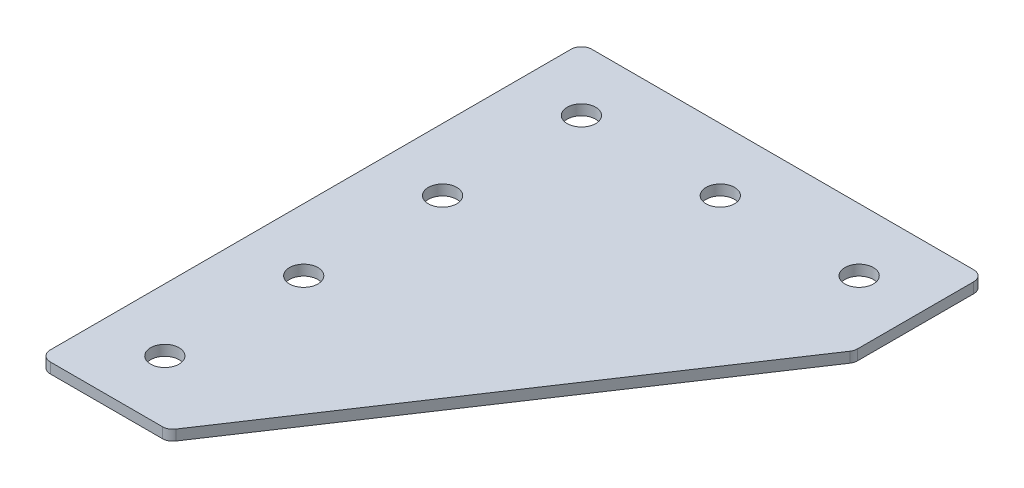
ISO-10303-21;
HEADER;
FILE_DESCRIPTION(('STEP AP214'),'2;1');
FILE_NAME('part.step','',(''),(''),'','','');
FILE_SCHEMA(('AUTOMOTIVE_DESIGN { 1 0 10303 214 1 1 1 1 }'));
ENDSEC;
DATA;
#1=APPLICATION_CONTEXT('core data for automotive mechanical design processes');
#2=APPLICATION_PROTOCOL_DEFINITION('international standard','automotive_design',2000,#1);
#3=PRODUCT_CONTEXT('',#1,'mechanical');
#4=PRODUCT('Part','Part','',(#3));
#5=PRODUCT_RELATED_PRODUCT_CATEGORY('part','',(#4));
#6=PRODUCT_DEFINITION_FORMATION('','',#4);
#7=PRODUCT_DEFINITION_CONTEXT('part definition',#1,'design');
#8=PRODUCT_DEFINITION('design','',#6,#7);
#9=PRODUCT_DEFINITION_SHAPE('','',#8);
#10=(LENGTH_UNIT() NAMED_UNIT(*) SI_UNIT(.MILLI.,.METRE.));
#11=(NAMED_UNIT(*) PLANE_ANGLE_UNIT() SI_UNIT($,.RADIAN.));
#12=(NAMED_UNIT(*) SI_UNIT($,.STERADIAN.) SOLID_ANGLE_UNIT());
#13=UNCERTAINTY_MEASURE_WITH_UNIT(LENGTH_MEASURE(1.E-05),#10,'distance_accuracy_value','');
#14=(GEOMETRIC_REPRESENTATION_CONTEXT(3) GLOBAL_UNCERTAINTY_ASSIGNED_CONTEXT((#13)) GLOBAL_UNIT_ASSIGNED_CONTEXT((#10,
#11,#12)) REPRESENTATION_CONTEXT('',''));
#15=CARTESIAN_POINT('',(0.,0.,0.));
#16=DIRECTION('',(0.,0.,1.));
#17=DIRECTION('',(1.,0.,0.));
#18=AXIS2_PLACEMENT_3D('',#15,#16,#17);
#19=CARTESIAN_POINT('',(-42.2329305968469,1.64126526075142,-60.907824161743));
#20=DIRECTION('',(0.,-1.,0.));
#21=DIRECTION('',(0.,0.,-1.));
#22=AXIS2_PLACEMENT_3D('',#19,#20,#21);
#23=PLANE('',#22);
#24=CARTESIAN_POINT('',(-42.2329305968469,1.64126526075142,59.092175838257));
#25=DIRECTION('',(0.,1.,0.));
#26=DIRECTION('',(0.,0.,1.));
#27=AXIS2_PLACEMENT_3D('',#24,#25,#26);
#28=CIRCLE('',#27,4.1);
#29=CARTESIAN_POINT('',(-42.2329305968469,1.64126526075142,63.192175838257));
#30=VERTEX_POINT('',#29);
#31=EDGE_CURVE('E253',#30,#30,#28,.T.);
#32=ORIENTED_EDGE('',*,*,#31,.T.);
#33=EDGE_LOOP('',(#32));
#34=FACE_BOUND('',#33,.T.);
#35=CARTESIAN_POINT('',(37.7670694031531,1.64126526075142,-60.907824161743));
#36=DIRECTION('',(0.,1.,0.));
#37=DIRECTION('',(0.,0.,1.));
#38=AXIS2_PLACEMENT_3D('',#35,#36,#37);
#39=CIRCLE('',#38,4.1);
#40=CARTESIAN_POINT('',(37.7670694031531,1.64126526075142,-56.807824161743));
#41=VERTEX_POINT('',#40);
#42=EDGE_CURVE('E261',#41,#41,#39,.T.);
#43=ORIENTED_EDGE('',*,*,#42,.T.);
#44=EDGE_LOOP('',(#43));
#45=FACE_BOUND('',#44,.T.);
#46=CARTESIAN_POINT('',(-42.2329305968469,1.64126526075142,19.092175838257));
#47=DIRECTION('',(0.,1.,0.));
#48=DIRECTION('',(0.,0.,1.));
#49=AXIS2_PLACEMENT_3D('',#46,#47,#48);
#50=CIRCLE('',#49,4.1);
#51=CARTESIAN_POINT('',(-42.2329305968469,1.64126526075142,23.192175838257));
#52=VERTEX_POINT('',#51);
#53=EDGE_CURVE('E267',#52,#52,#50,.T.);
#54=ORIENTED_EDGE('',*,*,#53,.T.);
#55=EDGE_LOOP('',(#54));
#56=FACE_BOUND('',#55,.T.);
#57=CARTESIAN_POINT('',(-42.2329305968469,1.64126526075142,-20.907824161743));
#58=DIRECTION('',(0.,1.,0.));
#59=DIRECTION('',(0.,0.,1.));
#60=AXIS2_PLACEMENT_3D('',#57,#58,#59);
#61=CIRCLE('',#60,4.1);
#62=CARTESIAN_POINT('',(-42.2329305968469,1.64126526075142,-16.807824161743));
#63=VERTEX_POINT('',#62);
#64=EDGE_CURVE('E273',#63,#63,#61,.T.);
#65=ORIENTED_EDGE('',*,*,#64,.T.);
#66=EDGE_LOOP('',(#65));
#67=FACE_BOUND('',#66,.T.);
#68=CARTESIAN_POINT('',(-2.23293059684691,1.64126526075142,-60.907824161743));
#69=DIRECTION('',(0.,1.,0.));
#70=DIRECTION('',(0.,0.,1.));
#71=AXIS2_PLACEMENT_3D('',#68,#69,#70);
#72=CIRCLE('',#71,4.1);
#73=CARTESIAN_POINT('',(-2.23293059684691,1.64126526075142,-56.807824161743));
#74=VERTEX_POINT('',#73);
#75=EDGE_CURVE('E279',#74,#74,#72,.T.);
#76=ORIENTED_EDGE('',*,*,#75,.T.);
#77=EDGE_LOOP('',(#76));
#78=FACE_BOUND('',#77,.T.);
#79=CARTESIAN_POINT('',(-42.2329305968469,1.64126526075142,-60.907824161743));
#80=DIRECTION('',(0.,1.,0.));
#81=DIRECTION('',(0.,0.,1.));
#82=AXIS2_PLACEMENT_3D('',#79,#80,#81);
#83=CIRCLE('',#82,4.1);
#84=CARTESIAN_POINT('',(-42.2329305968469,1.64126526075142,-56.807824161743));
#85=VERTEX_POINT('',#84);
#86=EDGE_CURVE('E176',#85,#85,#83,.T.);
#87=ORIENTED_EDGE('',*,*,#86,.T.);
#88=EDGE_LOOP('',(#87));
#89=FACE_BOUND('',#88,.T.);
#90=DIRECTION('',(1.,0.,0.));
#91=VECTOR('',#90,1.);
#92=CARTESIAN_POINT('',(-60.2329305968469,1.64126526075142,77.0921758382569));
#93=LINE('',#92,#91);
#94=CARTESIAN_POINT('',(-57.2329305968469,1.64126526075142,77.0921758382569));
#95=VERTEX_POINT('',#94);
#96=CARTESIAN_POINT('',(-24.9088493892869,1.64126526075142,77.0921758382569));
#97=VERTEX_POINT('',#96);
#98=EDGE_CURVE('E165',#95,#97,#93,.T.);
#99=ORIENTED_EDGE('',*,*,#98,.F.);
#100=CARTESIAN_POINT('',(-57.2329305968469,1.64126526075142,74.0921758382569));
#101=DIRECTION('',(0.,-1.,0.));
#102=DIRECTION('',(0.,0.,-1.));
#103=AXIS2_PLACEMENT_3D('',#100,#101,#102);
#104=CIRCLE('',#103,3.);
#105=CARTESIAN_POINT('',(-60.2329305968469,1.64126526075142,74.0921758382569));
#106=VERTEX_POINT('',#105);
#107=EDGE_CURVE('E146',#95,#106,#104,.T.);
#108=ORIENTED_EDGE('',*,*,#107,.T.);
#109=DIRECTION('',(0.,0.,1.));
#110=VECTOR('',#109,1.);
#111=CARTESIAN_POINT('',(-60.2329305968469,1.64126526075142,-78.907824161743));
#112=LINE('',#111,#110);
#113=CARTESIAN_POINT('',(-60.2329305968469,1.64126526075142,-75.907824161743));
#114=VERTEX_POINT('',#113);
#115=EDGE_CURVE('E163',#114,#106,#112,.T.);
#116=ORIENTED_EDGE('',*,*,#115,.F.);
#117=CARTESIAN_POINT('',(-57.2329305968469,1.64126526075142,-75.907824161743));
#118=DIRECTION('',(0.,-1.,0.));
#119=DIRECTION('',(0.,0.,-1.));
#120=AXIS2_PLACEMENT_3D('',#117,#118,#119);
#121=CIRCLE('',#120,3.);
#122=CARTESIAN_POINT('',(-57.2329305968469,1.64126526075142,-78.907824161743));
#123=VERTEX_POINT('',#122);
#124=EDGE_CURVE('E117',#114,#123,#121,.T.);
#125=ORIENTED_EDGE('',*,*,#124,.T.);
#126=DIRECTION('',(-1.,0.,0.));
#127=VECTOR('',#126,1.);
#128=CARTESIAN_POINT('',(55.7670694031531,1.64126526075142,-78.9078241617431));
#129=LINE('',#128,#127);
#130=CARTESIAN_POINT('',(52.7670694031531,1.64126526075142,-78.9078241617431));
#131=VERTEX_POINT('',#130);
#132=EDGE_CURVE('E161',#131,#123,#129,.T.);
#133=ORIENTED_EDGE('',*,*,#132,.F.);
#134=CARTESIAN_POINT('',(52.7670694031531,1.64126526075142,-75.9078241617431));
#135=DIRECTION('',(0.,-1.,0.));
#136=DIRECTION('',(0.,0.,-1.));
#137=AXIS2_PLACEMENT_3D('',#134,#135,#136);
#138=CIRCLE('',#137,3.);
#139=CARTESIAN_POINT('',(55.7670694031531,1.64126526075142,-75.9078241617431));
#140=VERTEX_POINT('',#139);
#141=EDGE_CURVE('E141',#131,#140,#138,.T.);
#142=ORIENTED_EDGE('',*,*,#141,.T.);
#143=DIRECTION('',(0.,0.,-1.));
#144=VECTOR('',#143,1.);
#145=CARTESIAN_POINT('',(55.7670694031531,1.64126526075142,-41.5133754372071));
#146=LINE('',#145,#144);
#147=CARTESIAN_POINT('',(55.7670694031531,1.64126526075142,-42.421702350403));
#148=VERTEX_POINT('',#147);
#149=EDGE_CURVE('E118',#148,#140,#146,.T.);
#150=ORIENTED_EDGE('',*,*,#149,.F.);
#151=CARTESIAN_POINT('',(52.7670694031531,1.64126526075142,-42.421702350403));
#152=DIRECTION('',(0.,-1.,0.));
#153=DIRECTION('',(0.,0.,-1.));
#154=AXIS2_PLACEMENT_3D('',#151,#152,#153);
#155=CIRCLE('',#154,3.);
#156=CARTESIAN_POINT('',(55.2632202861666,1.64126526075142,-40.7576017617274));
#157=VERTEX_POINT('',#156);
#158=EDGE_CURVE('E31',#148,#157,#155,.T.);
#159=ORIENTED_EDGE('',*,*,#158,.T.);
#160=DIRECTION('',(0.554700196225229,0.,-0.832050294337844));
#161=VECTOR('',#160,1.);
#162=CARTESIAN_POINT('',(-23.303298113823,1.64126526075142,77.0921758382569));
#163=LINE('',#162,#161);
#164=CARTESIAN_POINT('',(-22.4126985062734,1.64126526075142,75.7562764269326));
#165=VERTEX_POINT('',#164);
#166=EDGE_CURVE('E122',#165,#157,#163,.T.);
#167=ORIENTED_EDGE('',*,*,#166,.F.);
#168=CARTESIAN_POINT('',(-24.9088493892869,1.64126526075142,74.0921758382569));
#169=DIRECTION('',(0.,-1.,0.));
#170=DIRECTION('',(0.,0.,-1.));
#171=AXIS2_PLACEMENT_3D('',#168,#169,#170);
#172=CIRCLE('',#171,3.);
#173=EDGE_CURVE('E144',#165,#97,#172,.T.);
#174=ORIENTED_EDGE('',*,*,#173,.T.);
#175=EDGE_LOOP('',(#99,#108,#116,#125,#133,#142,#150,#159,#167,#174));
#176=FACE_BOUND('',#175,.T.);
#177=ADVANCED_FACE('F16',(#34,#45,#56,#67,#78,#89,#176),#23,.T.);
#178=CARTESIAN_POINT('',(55.7670694031531,1.64126526075142,-78.9078241617431));
#179=DIRECTION('',(0.,0.,-1.));
#180=DIRECTION('',(-1.,0.,0.));
#181=AXIS2_PLACEMENT_3D('',#178,#179,#180);
#182=PLANE('',#181);
#183=DIRECTION('',(-1.,0.,0.));
#184=VECTOR('',#183,1.);
#185=CARTESIAN_POINT('',(55.7670694031531,4.64126526075142,-78.9078241617431));
#186=LINE('',#185,#184);
#187=CARTESIAN_POINT('',(52.7670694031531,4.64126526075142,-78.9078241617431));
#188=VERTEX_POINT('',#187);
#189=CARTESIAN_POINT('',(-57.2329305968469,4.64126526075142,-78.907824161743));
#190=VERTEX_POINT('',#189);
#191=EDGE_CURVE('E99',#188,#190,#186,.T.);
#192=ORIENTED_EDGE('',*,*,#191,.F.);
#193=DIRECTION('',(0.,1.,0.));
#194=VECTOR('',#193,1.);
#195=CARTESIAN_POINT('',(52.7670694031531,1.64126526075142,-78.9078241617431));
#196=LINE('',#195,#194);
#197=EDGE_CURVE('E10',#188,#131,#196,.F.);
#198=ORIENTED_EDGE('',*,*,#197,.T.);
#199=ORIENTED_EDGE('',*,*,#132,.T.);
#200=DIRECTION('',(0.,1.,0.));
#201=VECTOR('',#200,1.);
#202=CARTESIAN_POINT('',(-57.2329305968469,1.64126526075142,-78.907824161743));
#203=LINE('',#202,#201);
#204=EDGE_CURVE('E24',#123,#190,#203,.T.);
#205=ORIENTED_EDGE('',*,*,#204,.T.);
#206=EDGE_LOOP('',(#192,#198,#199,#205));
#207=FACE_BOUND('',#206,.T.);
#208=ADVANCED_FACE('F158',(#207),#182,.T.);
#209=CARTESIAN_POINT('',(55.7670694031531,1.64126526075142,-41.5133754372071));
#210=DIRECTION('',(1.,0.,0.));
#211=DIRECTION('',(0.,0.,-1.));
#212=AXIS2_PLACEMENT_3D('',#209,#210,#211);
#213=PLANE('',#212);
#214=DIRECTION('',(0.,0.,-1.));
#215=VECTOR('',#214,1.);
#216=CARTESIAN_POINT('',(55.7670694031531,4.64126526075142,-41.5133754372071));
#217=LINE('',#216,#215);
#218=CARTESIAN_POINT('',(55.7670694031531,4.64126526075142,-42.421702350403));
#219=VERTEX_POINT('',#218);
#220=CARTESIAN_POINT('',(55.7670694031531,4.64126526075142,-75.9078241617431));
#221=VERTEX_POINT('',#220);
#222=EDGE_CURVE('E125',#219,#221,#217,.T.);
#223=ORIENTED_EDGE('',*,*,#222,.F.);
#224=DIRECTION('',(0.,1.,0.));
#225=VECTOR('',#224,1.);
#226=CARTESIAN_POINT('',(55.7670694031531,1.64126526075142,-42.421702350403));
#227=LINE('',#226,#225);
#228=EDGE_CURVE('E155',#219,#148,#227,.F.);
#229=ORIENTED_EDGE('',*,*,#228,.T.);
#230=ORIENTED_EDGE('',*,*,#149,.T.);
#231=DIRECTION('',(0.,1.,0.));
#232=VECTOR('',#231,1.);
#233=CARTESIAN_POINT('',(55.7670694031531,1.64126526075142,-75.9078241617431));
#234=LINE('',#233,#232);
#235=EDGE_CURVE('E152',#140,#221,#234,.T.);
#236=ORIENTED_EDGE('',*,*,#235,.T.);
#237=EDGE_LOOP('',(#223,#229,#230,#236));
#238=FACE_BOUND('',#237,.T.);
#239=ADVANCED_FACE('F212',(#238),#213,.T.);
#240=CARTESIAN_POINT('',(-23.303298113823,1.64126526075142,77.0921758382569));
#241=DIRECTION('',(0.832050294337843,0.,0.554700196225229));
#242=DIRECTION('',(0.554700196225229,0.,-0.832050294337844));
#243=AXIS2_PLACEMENT_3D('',#240,#241,#242);
#244=PLANE('',#243);
#245=DIRECTION('',(0.554700196225229,0.,-0.832050294337844));
#246=VECTOR('',#245,1.);
#247=CARTESIAN_POINT('',(-23.303298113823,4.64126526075142,77.0921758382569));
#248=LINE('',#247,#246);
#249=CARTESIAN_POINT('',(-22.4126985062734,4.64126526075142,75.7562764269326));
#250=VERTEX_POINT('',#249);
#251=CARTESIAN_POINT('',(55.2632202861666,4.64126526075142,-40.7576017617274));
#252=VERTEX_POINT('',#251);
#253=EDGE_CURVE('E168',#250,#252,#248,.T.);
#254=ORIENTED_EDGE('',*,*,#253,.F.);
#255=DIRECTION('',(0.,1.,0.));
#256=VECTOR('',#255,1.);
#257=CARTESIAN_POINT('',(-22.4126985062734,1.64126526075142,75.7562764269326));
#258=LINE('',#257,#256);
#259=EDGE_CURVE('E38',#250,#165,#258,.F.);
#260=ORIENTED_EDGE('',*,*,#259,.T.);
#261=ORIENTED_EDGE('',*,*,#166,.T.);
#262=DIRECTION('',(0.,1.,0.));
#263=VECTOR('',#262,1.);
#264=CARTESIAN_POINT('',(55.2632202861666,1.64126526075142,-40.7576017617274));
#265=LINE('',#264,#263);
#266=EDGE_CURVE('E148',#157,#252,#265,.T.);
#267=ORIENTED_EDGE('',*,*,#266,.T.);
#268=EDGE_LOOP('',(#254,#260,#261,#267));
#269=FACE_BOUND('',#268,.T.);
#270=ADVANCED_FACE('F181',(#269),#244,.T.);
#271=CARTESIAN_POINT('',(-60.2329305968469,1.64126526075142,77.0921758382569));
#272=DIRECTION('',(0.,0.,1.));
#273=DIRECTION('',(1.,0.,0.));
#274=AXIS2_PLACEMENT_3D('',#271,#272,#273);
#275=PLANE('',#274);
#276=DIRECTION('',(1.,0.,0.));
#277=VECTOR('',#276,1.);
#278=CARTESIAN_POINT('',(-60.2329305968469,4.64126526075142,77.0921758382569));
#279=LINE('',#278,#277);
#280=CARTESIAN_POINT('',(-57.2329305968469,4.64126526075142,77.0921758382569));
#281=VERTEX_POINT('',#280);
#282=CARTESIAN_POINT('',(-24.9088493892869,4.64126526075142,77.0921758382569));
#283=VERTEX_POINT('',#282);
#284=EDGE_CURVE('E114',#281,#283,#279,.T.);
#285=ORIENTED_EDGE('',*,*,#284,.F.);
#286=DIRECTION('',(0.,1.,0.));
#287=VECTOR('',#286,1.);
#288=CARTESIAN_POINT('',(-57.2329305968469,1.64126526075142,77.0921758382569));
#289=LINE('',#288,#287);
#290=EDGE_CURVE('E138',#281,#95,#289,.F.);
#291=ORIENTED_EDGE('',*,*,#290,.T.);
#292=ORIENTED_EDGE('',*,*,#98,.T.);
#293=DIRECTION('',(0.,1.,0.));
#294=VECTOR('',#293,1.);
#295=CARTESIAN_POINT('',(-24.9088493892869,1.64126526075142,77.0921758382569));
#296=LINE('',#295,#294);
#297=EDGE_CURVE('E135',#97,#283,#296,.T.);
#298=ORIENTED_EDGE('',*,*,#297,.T.);
#299=EDGE_LOOP('',(#285,#291,#292,#298));
#300=FACE_BOUND('',#299,.T.);
#301=ADVANCED_FACE('F191',(#300),#275,.T.);
#302=CARTESIAN_POINT('',(-60.2329305968469,1.64126526075142,-78.907824161743));
#303=DIRECTION('',(-1.,0.,0.));
#304=DIRECTION('',(0.,0.,1.));
#305=AXIS2_PLACEMENT_3D('',#302,#303,#304);
#306=PLANE('',#305);
#307=ORIENTED_EDGE('',*,*,#115,.T.);
#308=DIRECTION('',(0.,1.,0.));
#309=VECTOR('',#308,1.);
#310=CARTESIAN_POINT('',(-60.2329305968469,1.64126526075142,74.0921758382569));
#311=LINE('',#310,#309);
#312=CARTESIAN_POINT('',(-60.2329305968469,4.64126526075142,74.0921758382569));
#313=VERTEX_POINT('',#312);
#314=EDGE_CURVE('E105',#106,#313,#311,.T.);
#315=ORIENTED_EDGE('',*,*,#314,.T.);
#316=DIRECTION('',(0.,0.,1.));
#317=VECTOR('',#316,1.);
#318=CARTESIAN_POINT('',(-60.2329305968469,4.64126526075142,-78.907824161743));
#319=LINE('',#318,#317);
#320=CARTESIAN_POINT('',(-60.2329305968469,4.64126526075142,-75.907824161743));
#321=VERTEX_POINT('',#320);
#322=EDGE_CURVE('E97',#321,#313,#319,.T.);
#323=ORIENTED_EDGE('',*,*,#322,.F.);
#324=DIRECTION('',(0.,1.,0.));
#325=VECTOR('',#324,1.);
#326=CARTESIAN_POINT('',(-60.2329305968469,1.64126526075142,-75.907824161743));
#327=LINE('',#326,#325);
#328=EDGE_CURVE('E111',#321,#114,#327,.F.);
#329=ORIENTED_EDGE('',*,*,#328,.T.);
#330=EDGE_LOOP('',(#307,#315,#323,#329));
#331=FACE_BOUND('',#330,.T.);
#332=ADVANCED_FACE('F110',(#331),#306,.T.);
#333=CARTESIAN_POINT('',(-42.2329305968469,4.64126526075142,-60.907824161743));
#334=DIRECTION('',(0.,-1.,0.));
#335=DIRECTION('',(0.,0.,-1.));
#336=AXIS2_PLACEMENT_3D('',#333,#334,#335);
#337=PLANE('',#336);
#338=CARTESIAN_POINT('',(-42.2329305968469,4.64126526075142,59.092175838257));
#339=DIRECTION('',(0.,1.,0.));
#340=DIRECTION('',(0.,0.,1.));
#341=AXIS2_PLACEMENT_3D('',#338,#339,#340);
#342=CIRCLE('',#341,4.1);
#343=CARTESIAN_POINT('',(-42.2329305968469,4.64126526075142,63.192175838257));
#344=VERTEX_POINT('',#343);
#345=EDGE_CURVE('E256',#344,#344,#342,.T.);
#346=ORIENTED_EDGE('',*,*,#345,.F.);
#347=EDGE_LOOP('',(#346));
#348=FACE_BOUND('',#347,.T.);
#349=CARTESIAN_POINT('',(37.7670694031531,4.64126526075142,-60.907824161743));
#350=DIRECTION('',(0.,1.,0.));
#351=DIRECTION('',(0.,0.,1.));
#352=AXIS2_PLACEMENT_3D('',#349,#350,#351);
#353=CIRCLE('',#352,4.1);
#354=CARTESIAN_POINT('',(37.7670694031531,4.64126526075142,-56.807824161743));
#355=VERTEX_POINT('',#354);
#356=EDGE_CURVE('E258',#355,#355,#353,.T.);
#357=ORIENTED_EDGE('',*,*,#356,.F.);
#358=EDGE_LOOP('',(#357));
#359=FACE_BOUND('',#358,.T.);
#360=CARTESIAN_POINT('',(-42.2329305968469,4.64126526075142,19.092175838257));
#361=DIRECTION('',(0.,1.,0.));
#362=DIRECTION('',(0.,0.,1.));
#363=AXIS2_PLACEMENT_3D('',#360,#361,#362);
#364=CIRCLE('',#363,4.1);
#365=CARTESIAN_POINT('',(-42.2329305968469,4.64126526075142,23.192175838257));
#366=VERTEX_POINT('',#365);
#367=EDGE_CURVE('E264',#366,#366,#364,.T.);
#368=ORIENTED_EDGE('',*,*,#367,.F.);
#369=EDGE_LOOP('',(#368));
#370=FACE_BOUND('',#369,.T.);
#371=CARTESIAN_POINT('',(-42.2329305968469,4.64126526075142,-20.907824161743));
#372=DIRECTION('',(0.,1.,0.));
#373=DIRECTION('',(0.,0.,1.));
#374=AXIS2_PLACEMENT_3D('',#371,#372,#373);
#375=CIRCLE('',#374,4.1);
#376=CARTESIAN_POINT('',(-42.2329305968469,4.64126526075142,-16.807824161743));
#377=VERTEX_POINT('',#376);
#378=EDGE_CURVE('E270',#377,#377,#375,.T.);
#379=ORIENTED_EDGE('',*,*,#378,.F.);
#380=EDGE_LOOP('',(#379));
#381=FACE_BOUND('',#380,.T.);
#382=CARTESIAN_POINT('',(-2.23293059684691,4.64126526075142,-60.907824161743));
#383=DIRECTION('',(0.,1.,0.));
#384=DIRECTION('',(0.,0.,1.));
#385=AXIS2_PLACEMENT_3D('',#382,#383,#384);
#386=CIRCLE('',#385,4.1);
#387=CARTESIAN_POINT('',(-2.23293059684691,4.64126526075142,-56.807824161743));
#388=VERTEX_POINT('',#387);
#389=EDGE_CURVE('E276',#388,#388,#386,.T.);
#390=ORIENTED_EDGE('',*,*,#389,.F.);
#391=EDGE_LOOP('',(#390));
#392=FACE_BOUND('',#391,.T.);
#393=CARTESIAN_POINT('',(-42.2329305968469,4.64126526075142,-60.907824161743));
#394=DIRECTION('',(0.,1.,0.));
#395=DIRECTION('',(0.,0.,1.));
#396=AXIS2_PLACEMENT_3D('',#393,#394,#395);
#397=CIRCLE('',#396,4.1);
#398=CARTESIAN_POINT('',(-42.2329305968469,4.64126526075142,-56.807824161743));
#399=VERTEX_POINT('',#398);
#400=EDGE_CURVE('E170',#399,#399,#397,.T.);
#401=ORIENTED_EDGE('',*,*,#400,.F.);
#402=EDGE_LOOP('',(#401));
#403=FACE_BOUND('',#402,.T.);
#404=ORIENTED_EDGE('',*,*,#322,.T.);
#405=CARTESIAN_POINT('',(-57.2329305968469,4.64126526075142,74.0921758382569));
#406=DIRECTION('',(0.,-1.,0.));
#407=DIRECTION('',(0.,0.,-1.));
#408=AXIS2_PLACEMENT_3D('',#405,#406,#407);
#409=CIRCLE('',#408,3.);
#410=EDGE_CURVE('E133',#313,#281,#409,.F.);
#411=ORIENTED_EDGE('',*,*,#410,.T.);
#412=ORIENTED_EDGE('',*,*,#284,.T.);
#413=CARTESIAN_POINT('',(-24.9088493892869,4.64126526075142,74.0921758382569));
#414=DIRECTION('',(0.,-1.,0.));
#415=DIRECTION('',(0.,0.,-1.));
#416=AXIS2_PLACEMENT_3D('',#413,#414,#415);
#417=CIRCLE('',#416,3.);
#418=EDGE_CURVE('E131',#283,#250,#417,.F.);
#419=ORIENTED_EDGE('',*,*,#418,.T.);
#420=ORIENTED_EDGE('',*,*,#253,.T.);
#421=CARTESIAN_POINT('',(52.7670694031531,4.64126526075142,-42.421702350403));
#422=DIRECTION('',(0.,-1.,0.));
#423=DIRECTION('',(0.,0.,-1.));
#424=AXIS2_PLACEMENT_3D('',#421,#422,#423);
#425=CIRCLE('',#424,3.);
#426=EDGE_CURVE('E129',#252,#219,#425,.F.);
#427=ORIENTED_EDGE('',*,*,#426,.T.);
#428=ORIENTED_EDGE('',*,*,#222,.T.);
#429=CARTESIAN_POINT('',(52.7670694031531,4.64126526075142,-75.9078241617431));
#430=DIRECTION('',(0.,-1.,0.));
#431=DIRECTION('',(0.,0.,-1.));
#432=AXIS2_PLACEMENT_3D('',#429,#430,#431);
#433=CIRCLE('',#432,3.);
#434=EDGE_CURVE('E104',#221,#188,#433,.F.);
#435=ORIENTED_EDGE('',*,*,#434,.T.);
#436=ORIENTED_EDGE('',*,*,#191,.T.);
#437=CARTESIAN_POINT('',(-57.2329305968469,4.64126526075142,-75.907824161743));
#438=DIRECTION('',(0.,-1.,0.));
#439=DIRECTION('',(0.,0.,-1.));
#440=AXIS2_PLACEMENT_3D('',#437,#438,#439);
#441=CIRCLE('',#440,3.);
#442=EDGE_CURVE('E94',#190,#321,#441,.F.);
#443=ORIENTED_EDGE('',*,*,#442,.T.);
#444=EDGE_LOOP('',(#404,#411,#412,#419,#420,#427,#428,#435,#436,#443));
#445=FACE_BOUND('',#444,.T.);
#446=ADVANCED_FACE('F96',(#348,#359,#370,#381,#392,#403,#445),#337,.F.);
#447=CARTESIAN_POINT('',(-57.2329305968469,1.64126526075142,74.0921758382569));
#448=DIRECTION('',(0.,1.,0.));
#449=DIRECTION('',(0.,0.,1.));
#450=AXIS2_PLACEMENT_3D('',#447,#448,#449);
#451=CYLINDRICAL_SURFACE('',#450,3.);
#452=ORIENTED_EDGE('',*,*,#107,.F.);
#453=ORIENTED_EDGE('',*,*,#290,.F.);
#454=ORIENTED_EDGE('',*,*,#410,.F.);
#455=ORIENTED_EDGE('',*,*,#314,.F.);
#456=EDGE_LOOP('',(#452,#453,#454,#455));
#457=FACE_BOUND('',#456,.T.);
#458=ADVANCED_FACE('F194',(#457),#451,.T.);
#459=CARTESIAN_POINT('',(-24.9088493892869,1.64126526075142,74.0921758382569));
#460=DIRECTION('',(0.,1.,0.));
#461=DIRECTION('',(0.,0.,1.));
#462=AXIS2_PLACEMENT_3D('',#459,#460,#461);
#463=CYLINDRICAL_SURFACE('',#462,3.);
#464=ORIENTED_EDGE('',*,*,#173,.F.);
#465=ORIENTED_EDGE('',*,*,#259,.F.);
#466=ORIENTED_EDGE('',*,*,#418,.F.);
#467=ORIENTED_EDGE('',*,*,#297,.F.);
#468=EDGE_LOOP('',(#464,#465,#466,#467));
#469=FACE_BOUND('',#468,.T.);
#470=ADVANCED_FACE('F185',(#469),#463,.T.);
#471=CARTESIAN_POINT('',(52.7670694031531,1.64126526075142,-42.421702350403));
#472=DIRECTION('',(0.,1.,0.));
#473=DIRECTION('',(0.,0.,1.));
#474=AXIS2_PLACEMENT_3D('',#471,#472,#473);
#475=CYLINDRICAL_SURFACE('',#474,3.);
#476=ORIENTED_EDGE('',*,*,#158,.F.);
#477=ORIENTED_EDGE('',*,*,#228,.F.);
#478=ORIENTED_EDGE('',*,*,#426,.F.);
#479=ORIENTED_EDGE('',*,*,#266,.F.);
#480=EDGE_LOOP('',(#476,#477,#478,#479));
#481=FACE_BOUND('',#480,.T.);
#482=ADVANCED_FACE('F202',(#481),#475,.T.);
#483=CARTESIAN_POINT('',(52.7670694031531,1.64126526075142,-75.9078241617431));
#484=DIRECTION('',(0.,1.,0.));
#485=DIRECTION('',(0.,0.,1.));
#486=AXIS2_PLACEMENT_3D('',#483,#484,#485);
#487=CYLINDRICAL_SURFACE('',#486,3.);
#488=ORIENTED_EDGE('',*,*,#141,.F.);
#489=ORIENTED_EDGE('',*,*,#197,.F.);
#490=ORIENTED_EDGE('',*,*,#434,.F.);
#491=ORIENTED_EDGE('',*,*,#235,.F.);
#492=EDGE_LOOP('',(#488,#489,#490,#491));
#493=FACE_BOUND('',#492,.T.);
#494=ADVANCED_FACE('F337',(#493),#487,.T.);
#495=CARTESIAN_POINT('',(-57.2329305968469,1.64126526075142,-75.907824161743));
#496=DIRECTION('',(0.,1.,0.));
#497=DIRECTION('',(0.,0.,1.));
#498=AXIS2_PLACEMENT_3D('',#495,#496,#497);
#499=CYLINDRICAL_SURFACE('',#498,3.);
#500=ORIENTED_EDGE('',*,*,#124,.F.);
#501=ORIENTED_EDGE('',*,*,#328,.F.);
#502=ORIENTED_EDGE('',*,*,#442,.F.);
#503=ORIENTED_EDGE('',*,*,#204,.F.);
#504=EDGE_LOOP('',(#500,#501,#502,#503));
#505=FACE_BOUND('',#504,.T.);
#506=ADVANCED_FACE('F18',(#505),#499,.T.);
#507=CARTESIAN_POINT('',(-42.2329305968469,1.64126526075142,-60.907824161743));
#508=DIRECTION('',(0.,1.,0.));
#509=DIRECTION('',(0.,0.,1.));
#510=AXIS2_PLACEMENT_3D('',#507,#508,#509);
#511=CYLINDRICAL_SURFACE('',#510,4.1);
#512=ORIENTED_EDGE('',*,*,#86,.F.);
#513=EDGE_LOOP('',(#512));
#514=FACE_BOUND('',#513,.T.);
#515=ORIENTED_EDGE('',*,*,#400,.T.);
#516=EDGE_LOOP('',(#515));
#517=FACE_BOUND('',#516,.T.);
#518=ADVANCED_FACE('F226',(#514,#517),#511,.F.);
#519=CARTESIAN_POINT('',(-2.23293059684691,1.64126526075142,-60.907824161743));
#520=DIRECTION('',(0.,1.,0.));
#521=DIRECTION('',(0.,0.,1.));
#522=AXIS2_PLACEMENT_3D('',#519,#520,#521);
#523=CYLINDRICAL_SURFACE('',#522,4.1);
#524=ORIENTED_EDGE('',*,*,#75,.F.);
#525=EDGE_LOOP('',(#524));
#526=FACE_BOUND('',#525,.T.);
#527=ORIENTED_EDGE('',*,*,#389,.T.);
#528=EDGE_LOOP('',(#527));
#529=FACE_BOUND('',#528,.T.);
#530=ADVANCED_FACE('F229',(#526,#529),#523,.F.);
#531=CARTESIAN_POINT('',(-42.2329305968469,1.64126526075142,-20.907824161743));
#532=DIRECTION('',(0.,1.,0.));
#533=DIRECTION('',(0.,0.,1.));
#534=AXIS2_PLACEMENT_3D('',#531,#532,#533);
#535=CYLINDRICAL_SURFACE('',#534,4.1);
#536=ORIENTED_EDGE('',*,*,#64,.F.);
#537=EDGE_LOOP('',(#536));
#538=FACE_BOUND('',#537,.T.);
#539=ORIENTED_EDGE('',*,*,#378,.T.);
#540=EDGE_LOOP('',(#539));
#541=FACE_BOUND('',#540,.T.);
#542=ADVANCED_FACE('F233',(#538,#541),#535,.F.);
#543=CARTESIAN_POINT('',(-42.2329305968469,1.64126526075142,19.092175838257));
#544=DIRECTION('',(0.,1.,0.));
#545=DIRECTION('',(0.,0.,1.));
#546=AXIS2_PLACEMENT_3D('',#543,#544,#545);
#547=CYLINDRICAL_SURFACE('',#546,4.1);
#548=ORIENTED_EDGE('',*,*,#53,.F.);
#549=EDGE_LOOP('',(#548));
#550=FACE_BOUND('',#549,.T.);
#551=ORIENTED_EDGE('',*,*,#367,.T.);
#552=EDGE_LOOP('',(#551));
#553=FACE_BOUND('',#552,.T.);
#554=ADVANCED_FACE('F237',(#550,#553),#547,.F.);
#555=CARTESIAN_POINT('',(37.7670694031531,1.64126526075142,-60.907824161743));
#556=DIRECTION('',(0.,1.,0.));
#557=DIRECTION('',(0.,0.,1.));
#558=AXIS2_PLACEMENT_3D('',#555,#556,#557);
#559=CYLINDRICAL_SURFACE('',#558,4.1);
#560=ORIENTED_EDGE('',*,*,#42,.F.);
#561=EDGE_LOOP('',(#560));
#562=FACE_BOUND('',#561,.T.);
#563=ORIENTED_EDGE('',*,*,#356,.T.);
#564=EDGE_LOOP('',(#563));
#565=FACE_BOUND('',#564,.T.);
#566=ADVANCED_FACE('F241',(#562,#565),#559,.F.);
#567=CARTESIAN_POINT('',(-42.2329305968469,1.64126526075142,59.092175838257));
#568=DIRECTION('',(0.,1.,0.));
#569=DIRECTION('',(0.,0.,1.));
#570=AXIS2_PLACEMENT_3D('',#567,#568,#569);
#571=CYLINDRICAL_SURFACE('',#570,4.1);
#572=ORIENTED_EDGE('',*,*,#31,.F.);
#573=EDGE_LOOP('',(#572));
#574=FACE_BOUND('',#573,.T.);
#575=ORIENTED_EDGE('',*,*,#345,.T.);
#576=EDGE_LOOP('',(#575));
#577=FACE_BOUND('',#576,.T.);
#578=ADVANCED_FACE('F245',(#574,#577),#571,.F.);
#579=CLOSED_SHELL('',(#177,#208,#239,#270,#301,#332,#446,#458,#470,#482,#494,#506,#518,#530,
#542,#554,#566,#578));
#580=MANIFOLD_SOLID_BREP('B1',#579);
#581=ADVANCED_BREP_SHAPE_REPRESENTATION('',(#18,#580),#14);
#582=SHAPE_DEFINITION_REPRESENTATION(#9,#581);
ENDSEC;
END-ISO-10303-21;
